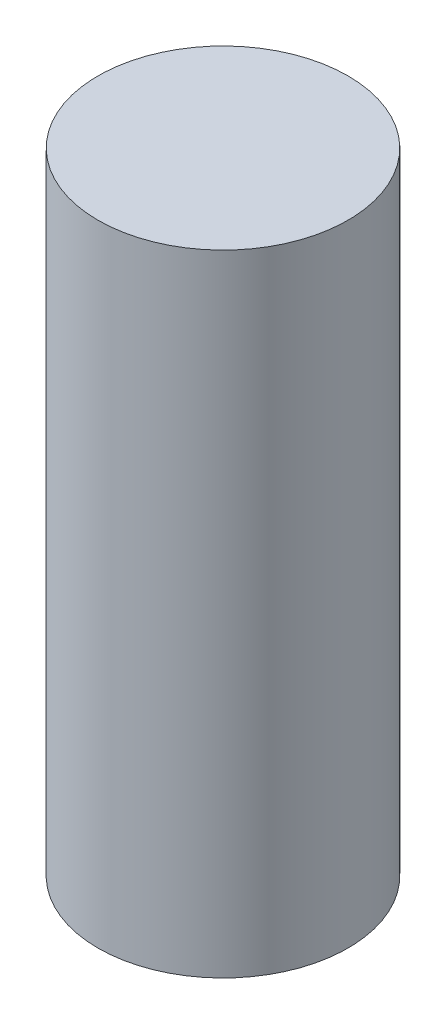
ISO-10303-21;
HEADER;
FILE_DESCRIPTION(('STEP AP214'),'2;1');
FILE_NAME('part.step','',(''),(''),'','','');
FILE_SCHEMA(('AUTOMOTIVE_DESIGN { 1 0 10303 214 1 1 1 1 }'));
ENDSEC;
DATA;
#1=APPLICATION_CONTEXT('core data for automotive mechanical design processes');
#2=APPLICATION_PROTOCOL_DEFINITION('international standard','automotive_design',2000,#1);
#3=PRODUCT_CONTEXT('',#1,'mechanical');
#4=PRODUCT('Part','Part','',(#3));
#5=PRODUCT_RELATED_PRODUCT_CATEGORY('part','',(#4));
#6=PRODUCT_DEFINITION_FORMATION('','',#4);
#7=PRODUCT_DEFINITION_CONTEXT('part definition',#1,'design');
#8=PRODUCT_DEFINITION('design','',#6,#7);
#9=PRODUCT_DEFINITION_SHAPE('','',#8);
#10=(LENGTH_UNIT() NAMED_UNIT(*) SI_UNIT(.MILLI.,.METRE.));
#11=(NAMED_UNIT(*) PLANE_ANGLE_UNIT() SI_UNIT($,.RADIAN.));
#12=(NAMED_UNIT(*) SI_UNIT($,.STERADIAN.) SOLID_ANGLE_UNIT());
#13=UNCERTAINTY_MEASURE_WITH_UNIT(LENGTH_MEASURE(1.E-05),#10,'distance_accuracy_value','');
#14=(GEOMETRIC_REPRESENTATION_CONTEXT(3) GLOBAL_UNCERTAINTY_ASSIGNED_CONTEXT((#13)) GLOBAL_UNIT_ASSIGNED_CONTEXT((#10,
#11,#12)) REPRESENTATION_CONTEXT('',''));
#15=CARTESIAN_POINT('',(0.,0.,0.));
#16=DIRECTION('',(0.,0.,1.));
#17=DIRECTION('',(1.,0.,0.));
#18=AXIS2_PLACEMENT_3D('',#15,#16,#17);
#19=CARTESIAN_POINT('',(0.,90.932,0.));
#20=DIRECTION('',(0.,-1.,0.));
#21=DIRECTION('',(0.,0.,-1.));
#22=AXIS2_PLACEMENT_3D('',#19,#20,#21);
#23=CYLINDRICAL_SURFACE('',#22,18.034);
#24=CARTESIAN_POINT('',(0.,90.932,0.));
#25=DIRECTION('',(0.,1.,0.));
#26=DIRECTION('',(0.,0.,1.));
#27=AXIS2_PLACEMENT_3D('',#24,#25,#26);
#28=CIRCLE('',#27,18.034);
#29=CARTESIAN_POINT('',(0.,90.932,18.034));
#30=VERTEX_POINT('',#29);
#31=EDGE_CURVE('E10',#30,#30,#28,.T.);
#32=ORIENTED_EDGE('',*,*,#31,.F.);
#33=EDGE_LOOP('',(#32));
#34=FACE_BOUND('',#33,.T.);
#35=CARTESIAN_POINT('',(0.,0.,0.));
#36=DIRECTION('',(0.,1.,0.));
#37=DIRECTION('',(0.,0.,1.));
#38=AXIS2_PLACEMENT_3D('',#35,#36,#37);
#39=CIRCLE('',#38,18.034);
#40=CARTESIAN_POINT('',(0.,0.,18.034));
#41=VERTEX_POINT('',#40);
#42=EDGE_CURVE('E33',#41,#41,#39,.T.);
#43=ORIENTED_EDGE('',*,*,#42,.T.);
#44=EDGE_LOOP('',(#43));
#45=FACE_BOUND('',#44,.T.);
#46=ADVANCED_FACE('F30',(#34,#45),#23,.T.);
#47=CARTESIAN_POINT('',(0.,90.932,0.));
#48=DIRECTION('',(0.,1.,0.));
#49=DIRECTION('',(0.,0.,1.));
#50=AXIS2_PLACEMENT_3D('',#47,#48,#49);
#51=PLANE('',#50);
#52=ORIENTED_EDGE('',*,*,#31,.T.);
#53=EDGE_LOOP('',(#52));
#54=FACE_BOUND('',#53,.T.);
#55=ADVANCED_FACE('F45',(#54),#51,.T.);
#56=CARTESIAN_POINT('',(0.,0.,0.));
#57=DIRECTION('',(0.,1.,0.));
#58=DIRECTION('',(0.,0.,1.));
#59=AXIS2_PLACEMENT_3D('',#56,#57,#58);
#60=PLANE('',#59);
#61=ORIENTED_EDGE('',*,*,#42,.F.);
#62=EDGE_LOOP('',(#61));
#63=FACE_BOUND('',#62,.T.);
#64=ADVANCED_FACE('F43',(#63),#60,.F.);
#65=CLOSED_SHELL('',(#46,#55,#64));
#66=MANIFOLD_SOLID_BREP('B2',#65);
#67=ADVANCED_BREP_SHAPE_REPRESENTATION('',(#18,#66),#14);
#68=SHAPE_DEFINITION_REPRESENTATION(#9,#67);
ENDSEC;
END-ISO-10303-21;
